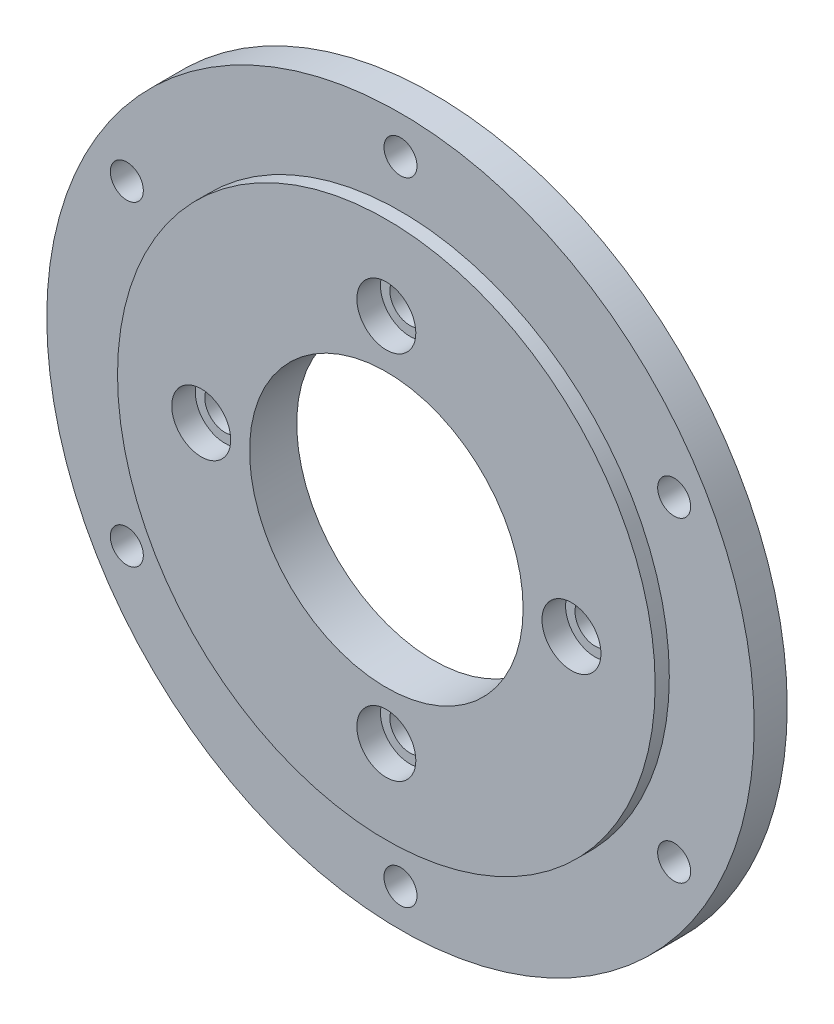
ISO-10303-21;
HEADER;
FILE_DESCRIPTION(('STEP AP214'),'2;1');
FILE_NAME('part.step','',(''),(''),'','','');
FILE_SCHEMA(('AUTOMOTIVE_DESIGN { 1 0 10303 214 1 1 1 1 }'));
ENDSEC;
DATA;
#1=APPLICATION_CONTEXT('core data for automotive mechanical design processes');
#2=APPLICATION_PROTOCOL_DEFINITION('international standard','automotive_design',2000,#1);
#3=PRODUCT_CONTEXT('',#1,'mechanical');
#4=PRODUCT('Part','Part','',(#3));
#5=PRODUCT_RELATED_PRODUCT_CATEGORY('part','',(#4));
#6=PRODUCT_DEFINITION_FORMATION('','',#4);
#7=PRODUCT_DEFINITION_CONTEXT('part definition',#1,'design');
#8=PRODUCT_DEFINITION('design','',#6,#7);
#9=PRODUCT_DEFINITION_SHAPE('','',#8);
#10=(LENGTH_UNIT() NAMED_UNIT(*) SI_UNIT(.MILLI.,.METRE.));
#11=(NAMED_UNIT(*) PLANE_ANGLE_UNIT() SI_UNIT($,.RADIAN.));
#12=(NAMED_UNIT(*) SI_UNIT($,.STERADIAN.) SOLID_ANGLE_UNIT());
#13=UNCERTAINTY_MEASURE_WITH_UNIT(LENGTH_MEASURE(1.E-05),#10,'distance_accuracy_value','');
#14=(GEOMETRIC_REPRESENTATION_CONTEXT(3) GLOBAL_UNCERTAINTY_ASSIGNED_CONTEXT((#13)) GLOBAL_UNIT_ASSIGNED_CONTEXT((#10,
#11,#12)) REPRESENTATION_CONTEXT('',''));
#15=CARTESIAN_POINT('',(0.,0.,0.));
#16=DIRECTION('',(0.,0.,1.));
#17=DIRECTION('',(1.,0.,0.));
#18=AXIS2_PLACEMENT_3D('',#15,#16,#17);
#19=CARTESIAN_POINT('',(0.,0.,10.));
#20=DIRECTION('',(0.,0.,1.));
#21=DIRECTION('',(1.,0.,0.));
#22=AXIS2_PLACEMENT_3D('',#19,#20,#21);
#23=PLANE('',#22);
#24=CARTESIAN_POINT('',(39.25,4.11121927648779E-13,10.));
#25=DIRECTION('',(0.,0.,1.));
#26=DIRECTION('',(1.,0.,0.));
#27=AXIS2_PLACEMENT_3D('',#24,#25,#26);
#28=CIRCLE('',#27,6.25000000000001);
#29=CARTESIAN_POINT('',(45.5,4.11121927648779E-13,10.));
#30=VERTEX_POINT('',#29);
#31=EDGE_CURVE('E129',#30,#30,#28,.T.);
#32=ORIENTED_EDGE('',*,*,#31,.F.);
#33=EDGE_LOOP('',(#32));
#34=FACE_BOUND('',#33,.T.);
#35=CARTESIAN_POINT('',(0.,-39.25,10.));
#36=DIRECTION('',(0.,0.,1.));
#37=DIRECTION('',(1.,0.,0.));
#38=AXIS2_PLACEMENT_3D('',#35,#36,#37);
#39=CIRCLE('',#38,6.25000000000001);
#40=CARTESIAN_POINT('',(6.25000000000001,-39.25,10.));
#41=VERTEX_POINT('',#40);
#42=EDGE_CURVE('E113',#41,#41,#39,.T.);
#43=ORIENTED_EDGE('',*,*,#42,.F.);
#44=EDGE_LOOP('',(#43));
#45=FACE_BOUND('',#44,.T.);
#46=CARTESIAN_POINT('',(-39.25,-1.37040642549593E-13,10.));
#47=DIRECTION('',(0.,0.,1.));
#48=DIRECTION('',(1.,0.,0.));
#49=AXIS2_PLACEMENT_3D('',#46,#47,#48);
#50=CIRCLE('',#49,6.25000000000001);
#51=CARTESIAN_POINT('',(-33.,-1.37040642549593E-13,10.));
#52=VERTEX_POINT('',#51);
#53=EDGE_CURVE('E97',#52,#52,#50,.T.);
#54=ORIENTED_EDGE('',*,*,#53,.F.);
#55=EDGE_LOOP('',(#54));
#56=FACE_BOUND('',#55,.T.);
#57=CARTESIAN_POINT('',(0.,39.25,10.));
#58=DIRECTION('',(0.,0.,1.));
#59=DIRECTION('',(1.,0.,0.));
#60=AXIS2_PLACEMENT_3D('',#57,#58,#59);
#61=CIRCLE('',#60,6.25000000000001);
#62=CARTESIAN_POINT('',(6.25000000000001,39.25,10.));
#63=VERTEX_POINT('',#62);
#64=EDGE_CURVE('E81',#63,#63,#61,.T.);
#65=ORIENTED_EDGE('',*,*,#64,.F.);
#66=EDGE_LOOP('',(#65));
#67=FACE_BOUND('',#66,.T.);
#68=CARTESIAN_POINT('',(0.,0.,10.));
#69=DIRECTION('',(0.,0.,1.));
#70=DIRECTION('',(1.,0.,0.));
#71=AXIS2_PLACEMENT_3D('',#68,#69,#70);
#72=CIRCLE('',#71,29.);
#73=CARTESIAN_POINT('',(29.,0.,10.));
#74=VERTEX_POINT('',#73);
#75=EDGE_CURVE('E50',#74,#74,#72,.T.);
#76=ORIENTED_EDGE('',*,*,#75,.F.);
#77=EDGE_LOOP('',(#76));
#78=FACE_BOUND('',#77,.T.);
#79=CARTESIAN_POINT('',(0.,0.,10.));
#80=DIRECTION('',(0.,0.,1.));
#81=DIRECTION('',(1.,0.,0.));
#82=AXIS2_PLACEMENT_3D('',#79,#80,#81);
#83=CIRCLE('',#82,57.);
#84=CARTESIAN_POINT('',(57.,0.,10.));
#85=VERTEX_POINT('',#84);
#86=EDGE_CURVE('E61',#85,#85,#83,.T.);
#87=ORIENTED_EDGE('',*,*,#86,.T.);
#88=EDGE_LOOP('',(#87));
#89=FACE_BOUND('',#88,.T.);
#90=ADVANCED_FACE('F41',(#34,#45,#56,#67,#78,#89),#23,.T.);
#91=CARTESIAN_POINT('',(0.,0.,10.));
#92=DIRECTION('',(0.,0.,-1.));
#93=DIRECTION('',(-1.,0.,0.));
#94=AXIS2_PLACEMENT_3D('',#91,#92,#93);
#95=CYLINDRICAL_SURFACE('',#94,75.);
#96=CARTESIAN_POINT('',(0.,0.,0.));
#97=DIRECTION('',(0.,0.,1.));
#98=DIRECTION('',(1.,0.,0.));
#99=AXIS2_PLACEMENT_3D('',#96,#97,#98);
#100=CIRCLE('',#99,75.);
#101=CARTESIAN_POINT('',(75.,0.,0.));
#102=VERTEX_POINT('',#101);
#103=EDGE_CURVE('E10',#102,#102,#100,.T.);
#104=ORIENTED_EDGE('',*,*,#103,.T.);
#105=EDGE_LOOP('',(#104));
#106=FACE_BOUND('',#105,.T.);
#107=CARTESIAN_POINT('',(0.,0.,7.));
#108=DIRECTION('',(0.,0.,1.));
#109=DIRECTION('',(1.,0.,0.));
#110=AXIS2_PLACEMENT_3D('',#107,#108,#109);
#111=CIRCLE('',#110,75.);
#112=CARTESIAN_POINT('',(75.,0.,7.));
#113=VERTEX_POINT('',#112);
#114=EDGE_CURVE('E45',#113,#113,#111,.T.);
#115=ORIENTED_EDGE('',*,*,#114,.F.);
#116=EDGE_LOOP('',(#115));
#117=FACE_BOUND('',#116,.T.);
#118=ADVANCED_FACE('F43',(#106,#117),#95,.T.);
#119=CARTESIAN_POINT('',(0.,0.,0.));
#120=DIRECTION('',(0.,0.,1.));
#121=DIRECTION('',(1.,0.,0.));
#122=AXIS2_PLACEMENT_3D('',#119,#120,#121);
#123=PLANE('',#122);
#124=CARTESIAN_POINT('',(58.023702053557,33.5000000000007,0.));
#125=DIRECTION('',(0.,0.,1.));
#126=DIRECTION('',(1.,0.,0.));
#127=AXIS2_PLACEMENT_3D('',#124,#125,#126);
#128=CIRCLE('',#127,3.50000000000001);
#129=CARTESIAN_POINT('',(61.523702053557,33.5000000000007,0.));
#130=VERTEX_POINT('',#129);
#131=EDGE_CURVE('E173',#130,#130,#128,.T.);
#132=ORIENTED_EDGE('',*,*,#131,.T.);
#133=EDGE_LOOP('',(#132));
#134=FACE_BOUND('',#133,.T.);
#135=CARTESIAN_POINT('',(58.0237020535577,-33.4999999999994,0.));
#136=DIRECTION('',(0.,0.,1.));
#137=DIRECTION('',(1.,0.,0.));
#138=AXIS2_PLACEMENT_3D('',#135,#136,#137);
#139=CIRCLE('',#138,3.50000000000001);
#140=CARTESIAN_POINT('',(61.5237020535577,-33.4999999999994,0.));
#141=VERTEX_POINT('',#140);
#142=EDGE_CURVE('E165',#141,#141,#139,.T.);
#143=ORIENTED_EDGE('',*,*,#142,.T.);
#144=EDGE_LOOP('',(#143));
#145=FACE_BOUND('',#144,.T.);
#146=CARTESIAN_POINT('',(0.,-67.,0.));
#147=DIRECTION('',(0.,0.,1.));
#148=DIRECTION('',(1.,0.,0.));
#149=AXIS2_PLACEMENT_3D('',#146,#147,#148);
#150=CIRCLE('',#149,3.50000000000001);
#151=CARTESIAN_POINT('',(3.50000000000001,-67.,0.));
#152=VERTEX_POINT('',#151);
#153=EDGE_CURVE('E157',#152,#152,#150,.T.);
#154=ORIENTED_EDGE('',*,*,#153,.T.);
#155=EDGE_LOOP('',(#154));
#156=FACE_BOUND('',#155,.T.);
#157=CARTESIAN_POINT('',(-58.0237020535572,-33.5000000000003,0.));
#158=DIRECTION('',(0.,0.,1.));
#159=DIRECTION('',(1.,0.,0.));
#160=AXIS2_PLACEMENT_3D('',#157,#158,#159);
#161=CIRCLE('',#160,3.50000000000002);
#162=CARTESIAN_POINT('',(-54.5237020535572,-33.5000000000003,0.));
#163=VERTEX_POINT('',#162);
#164=EDGE_CURVE('E149',#163,#163,#161,.T.);
#165=ORIENTED_EDGE('',*,*,#164,.T.);
#166=EDGE_LOOP('',(#165));
#167=FACE_BOUND('',#166,.T.);
#168=CARTESIAN_POINT('',(-58.0237020535574,33.4999999999999,0.));
#169=DIRECTION('',(0.,0.,1.));
#170=DIRECTION('',(1.,0.,0.));
#171=AXIS2_PLACEMENT_3D('',#168,#169,#170);
#172=CIRCLE('',#171,3.50000000000002);
#173=CARTESIAN_POINT('',(-54.5237020535574,33.4999999999999,0.));
#174=VERTEX_POINT('',#173);
#175=EDGE_CURVE('E141',#174,#174,#172,.T.);
#176=ORIENTED_EDGE('',*,*,#175,.T.);
#177=EDGE_LOOP('',(#176));
#178=FACE_BOUND('',#177,.T.);
#179=CARTESIAN_POINT('',(0.,67.,0.));
#180=DIRECTION('',(0.,0.,1.));
#181=DIRECTION('',(1.,0.,0.));
#182=AXIS2_PLACEMENT_3D('',#179,#180,#181);
#183=CIRCLE('',#182,3.50000000000001);
#184=CARTESIAN_POINT('',(3.50000000000001,67.,0.));
#185=VERTEX_POINT('',#184);
#186=EDGE_CURVE('E133',#185,#185,#183,.T.);
#187=ORIENTED_EDGE('',*,*,#186,.T.);
#188=EDGE_LOOP('',(#187));
#189=FACE_BOUND('',#188,.T.);
#190=CARTESIAN_POINT('',(39.25,4.11121927648779E-13,0.));
#191=DIRECTION('',(0.,0.,1.));
#192=DIRECTION('',(1.,0.,0.));
#193=AXIS2_PLACEMENT_3D('',#190,#191,#192);
#194=CIRCLE('',#193,4.25000000000001);
#195=CARTESIAN_POINT('',(43.5,4.11121927648779E-13,0.));
#196=VERTEX_POINT('',#195);
#197=EDGE_CURVE('E117',#196,#196,#194,.T.);
#198=ORIENTED_EDGE('',*,*,#197,.T.);
#199=EDGE_LOOP('',(#198));
#200=FACE_BOUND('',#199,.T.);
#201=CARTESIAN_POINT('',(0.,-39.25,0.));
#202=DIRECTION('',(0.,0.,1.));
#203=DIRECTION('',(1.,0.,0.));
#204=AXIS2_PLACEMENT_3D('',#201,#202,#203);
#205=CIRCLE('',#204,4.25000000000001);
#206=CARTESIAN_POINT('',(4.25000000000001,-39.25,0.));
#207=VERTEX_POINT('',#206);
#208=EDGE_CURVE('E101',#207,#207,#205,.T.);
#209=ORIENTED_EDGE('',*,*,#208,.T.);
#210=EDGE_LOOP('',(#209));
#211=FACE_BOUND('',#210,.T.);
#212=CARTESIAN_POINT('',(-39.25,-1.37040642549593E-13,0.));
#213=DIRECTION('',(0.,0.,1.));
#214=DIRECTION('',(1.,0.,0.));
#215=AXIS2_PLACEMENT_3D('',#212,#213,#214);
#216=CIRCLE('',#215,4.25000000000001);
#217=CARTESIAN_POINT('',(-35.,-1.37040642549593E-13,0.));
#218=VERTEX_POINT('',#217);
#219=EDGE_CURVE('E85',#218,#218,#216,.T.);
#220=ORIENTED_EDGE('',*,*,#219,.T.);
#221=EDGE_LOOP('',(#220));
#222=FACE_BOUND('',#221,.T.);
#223=CARTESIAN_POINT('',(0.,39.25,0.));
#224=DIRECTION('',(0.,0.,1.));
#225=DIRECTION('',(1.,0.,0.));
#226=AXIS2_PLACEMENT_3D('',#223,#224,#225);
#227=CIRCLE('',#226,4.25000000000001);
#228=CARTESIAN_POINT('',(4.25000000000001,39.25,0.));
#229=VERTEX_POINT('',#228);
#230=EDGE_CURVE('E66',#229,#229,#227,.T.);
#231=ORIENTED_EDGE('',*,*,#230,.T.);
#232=EDGE_LOOP('',(#231));
#233=FACE_BOUND('',#232,.T.);
#234=ORIENTED_EDGE('',*,*,#103,.F.);
#235=EDGE_LOOP('',(#234));
#236=FACE_BOUND('',#235,.T.);
#237=CARTESIAN_POINT('',(0.,0.,0.));
#238=DIRECTION('',(0.,0.,1.));
#239=DIRECTION('',(1.,0.,0.));
#240=AXIS2_PLACEMENT_3D('',#237,#238,#239);
#241=CIRCLE('',#240,29.);
#242=CARTESIAN_POINT('',(29.,0.,0.));
#243=VERTEX_POINT('',#242);
#244=EDGE_CURVE('E55',#243,#243,#241,.T.);
#245=ORIENTED_EDGE('',*,*,#244,.T.);
#246=EDGE_LOOP('',(#245));
#247=FACE_BOUND('',#246,.T.);
#248=ADVANCED_FACE('F207',(#134,#145,#156,#167,#178,#189,#200,#211,#222,#233,#236,#247),#123,.F.);
#249=CARTESIAN_POINT('',(0.,0.,10.));
#250=DIRECTION('',(0.,0.,-1.));
#251=DIRECTION('',(-1.,0.,0.));
#252=AXIS2_PLACEMENT_3D('',#249,#250,#251);
#253=CYLINDRICAL_SURFACE('',#252,29.);
#254=ORIENTED_EDGE('',*,*,#75,.T.);
#255=EDGE_LOOP('',(#254));
#256=FACE_BOUND('',#255,.T.);
#257=ORIENTED_EDGE('',*,*,#244,.F.);
#258=EDGE_LOOP('',(#257));
#259=FACE_BOUND('',#258,.T.);
#260=ADVANCED_FACE('F188',(#256,#259),#253,.F.);
#261=CARTESIAN_POINT('',(0.,0.,7.));
#262=DIRECTION('',(0.,0.,1.));
#263=DIRECTION('',(1.,0.,0.));
#264=AXIS2_PLACEMENT_3D('',#261,#262,#263);
#265=PLANE('',#264);
#266=CARTESIAN_POINT('',(58.023702053557,33.5000000000007,7.));
#267=DIRECTION('',(0.,0.,1.));
#268=DIRECTION('',(1.,0.,0.));
#269=AXIS2_PLACEMENT_3D('',#266,#267,#268);
#270=CIRCLE('',#269,3.50000000000002);
#271=CARTESIAN_POINT('',(61.523702053557,33.5000000000007,7.));
#272=VERTEX_POINT('',#271);
#273=EDGE_CURVE('E177',#272,#272,#270,.T.);
#274=ORIENTED_EDGE('',*,*,#273,.F.);
#275=EDGE_LOOP('',(#274));
#276=FACE_BOUND('',#275,.T.);
#277=CARTESIAN_POINT('',(58.0237020535577,-33.4999999999994,7.));
#278=DIRECTION('',(0.,0.,1.));
#279=DIRECTION('',(1.,0.,0.));
#280=AXIS2_PLACEMENT_3D('',#277,#278,#279);
#281=CIRCLE('',#280,3.50000000000002);
#282=CARTESIAN_POINT('',(61.5237020535577,-33.4999999999994,7.));
#283=VERTEX_POINT('',#282);
#284=EDGE_CURVE('E169',#283,#283,#281,.T.);
#285=ORIENTED_EDGE('',*,*,#284,.F.);
#286=EDGE_LOOP('',(#285));
#287=FACE_BOUND('',#286,.T.);
#288=CARTESIAN_POINT('',(0.,-67.,7.));
#289=DIRECTION('',(0.,0.,1.));
#290=DIRECTION('',(1.,0.,0.));
#291=AXIS2_PLACEMENT_3D('',#288,#289,#290);
#292=CIRCLE('',#291,3.50000000000001);
#293=CARTESIAN_POINT('',(3.50000000000001,-67.,7.));
#294=VERTEX_POINT('',#293);
#295=EDGE_CURVE('E161',#294,#294,#292,.T.);
#296=ORIENTED_EDGE('',*,*,#295,.F.);
#297=EDGE_LOOP('',(#296));
#298=FACE_BOUND('',#297,.T.);
#299=CARTESIAN_POINT('',(-58.0237020535572,-33.5000000000003,7.));
#300=DIRECTION('',(0.,0.,1.));
#301=DIRECTION('',(1.,0.,0.));
#302=AXIS2_PLACEMENT_3D('',#299,#300,#301);
#303=CIRCLE('',#302,3.50000000000002);
#304=CARTESIAN_POINT('',(-54.5237020535572,-33.5000000000003,7.));
#305=VERTEX_POINT('',#304);
#306=EDGE_CURVE('E153',#305,#305,#303,.T.);
#307=ORIENTED_EDGE('',*,*,#306,.F.);
#308=EDGE_LOOP('',(#307));
#309=FACE_BOUND('',#308,.T.);
#310=CARTESIAN_POINT('',(-58.0237020535574,33.4999999999999,7.));
#311=DIRECTION('',(0.,0.,1.));
#312=DIRECTION('',(1.,0.,0.));
#313=AXIS2_PLACEMENT_3D('',#310,#311,#312);
#314=CIRCLE('',#313,3.50000000000002);
#315=CARTESIAN_POINT('',(-54.5237020535574,33.4999999999999,7.));
#316=VERTEX_POINT('',#315);
#317=EDGE_CURVE('E145',#316,#316,#314,.T.);
#318=ORIENTED_EDGE('',*,*,#317,.F.);
#319=EDGE_LOOP('',(#318));
#320=FACE_BOUND('',#319,.T.);
#321=CARTESIAN_POINT('',(0.,67.,7.));
#322=DIRECTION('',(0.,0.,1.));
#323=DIRECTION('',(1.,0.,0.));
#324=AXIS2_PLACEMENT_3D('',#321,#322,#323);
#325=CIRCLE('',#324,3.50000000000001);
#326=CARTESIAN_POINT('',(3.50000000000001,67.,7.));
#327=VERTEX_POINT('',#326);
#328=EDGE_CURVE('E137',#327,#327,#325,.T.);
#329=ORIENTED_EDGE('',*,*,#328,.F.);
#330=EDGE_LOOP('',(#329));
#331=FACE_BOUND('',#330,.T.);
#332=CARTESIAN_POINT('',(0.,0.,7.));
#333=DIRECTION('',(0.,0.,1.));
#334=DIRECTION('',(1.,0.,0.));
#335=AXIS2_PLACEMENT_3D('',#332,#333,#334);
#336=CIRCLE('',#335,57.);
#337=CARTESIAN_POINT('',(57.,0.,7.));
#338=VERTEX_POINT('',#337);
#339=EDGE_CURVE('E65',#338,#338,#336,.T.);
#340=ORIENTED_EDGE('',*,*,#339,.F.);
#341=EDGE_LOOP('',(#340));
#342=FACE_BOUND('',#341,.T.);
#343=ORIENTED_EDGE('',*,*,#114,.T.);
#344=EDGE_LOOP('',(#343));
#345=FACE_BOUND('',#344,.T.);
#346=ADVANCED_FACE('F184',(#276,#287,#298,#309,#320,#331,#342,#345),#265,.T.);
#347=CARTESIAN_POINT('',(0.,0.,7.));
#348=DIRECTION('',(0.,0.,1.));
#349=DIRECTION('',(1.,0.,0.));
#350=AXIS2_PLACEMENT_3D('',#347,#348,#349);
#351=CYLINDRICAL_SURFACE('',#350,57.);
#352=ORIENTED_EDGE('',*,*,#339,.T.);
#353=EDGE_LOOP('',(#352));
#354=FACE_BOUND('',#353,.T.);
#355=ORIENTED_EDGE('',*,*,#86,.F.);
#356=EDGE_LOOP('',(#355));
#357=FACE_BOUND('',#356,.T.);
#358=ADVANCED_FACE('F187',(#354,#357),#351,.T.);
#359=CARTESIAN_POINT('',(0.,39.25,10.));
#360=DIRECTION('',(0.,0.,1.));
#361=DIRECTION('',(1.,0.,0.));
#362=AXIS2_PLACEMENT_3D('',#359,#360,#361);
#363=CYLINDRICAL_SURFACE('',#362,4.25000000000001);
#364=ORIENTED_EDGE('',*,*,#230,.F.);
#365=EDGE_LOOP('',(#364));
#366=FACE_BOUND('',#365,.T.);
#367=CARTESIAN_POINT('',(0.,39.25,5.));
#368=DIRECTION('',(0.,0.,1.));
#369=DIRECTION('',(1.,0.,0.));
#370=AXIS2_PLACEMENT_3D('',#367,#368,#369);
#371=CIRCLE('',#370,4.25000000000001);
#372=CARTESIAN_POINT('',(4.25000000000001,39.25,5.));
#373=VERTEX_POINT('',#372);
#374=EDGE_CURVE('E73',#373,#373,#371,.T.);
#375=ORIENTED_EDGE('',*,*,#374,.T.);
#376=EDGE_LOOP('',(#375));
#377=FACE_BOUND('',#376,.T.);
#378=ADVANCED_FACE('F225',(#366,#377),#363,.F.);
#379=CARTESIAN_POINT('',(4.25000000000001,39.25,5.));
#380=DIRECTION('',(0.,0.,-1.));
#381=DIRECTION('',(-1.,0.,0.));
#382=AXIS2_PLACEMENT_3D('',#379,#380,#381);
#383=PLANE('',#382);
#384=ORIENTED_EDGE('',*,*,#374,.F.);
#385=EDGE_LOOP('',(#384));
#386=FACE_BOUND('',#385,.T.);
#387=CARTESIAN_POINT('',(0.,39.25,5.));
#388=DIRECTION('',(0.,0.,1.));
#389=DIRECTION('',(1.,0.,0.));
#390=AXIS2_PLACEMENT_3D('',#387,#388,#389);
#391=CIRCLE('',#390,6.25000000000001);
#392=CARTESIAN_POINT('',(6.25000000000001,39.25,5.));
#393=VERTEX_POINT('',#392);
#394=EDGE_CURVE('E77',#393,#393,#391,.T.);
#395=ORIENTED_EDGE('',*,*,#394,.T.);
#396=EDGE_LOOP('',(#395));
#397=FACE_BOUND('',#396,.T.);
#398=ADVANCED_FACE('F229',(#386,#397),#383,.F.);
#399=CARTESIAN_POINT('',(0.,39.25,10.));
#400=DIRECTION('',(0.,0.,1.));
#401=DIRECTION('',(1.,0.,0.));
#402=AXIS2_PLACEMENT_3D('',#399,#400,#401);
#403=CYLINDRICAL_SURFACE('',#402,6.25000000000001);
#404=ORIENTED_EDGE('',*,*,#394,.F.);
#405=EDGE_LOOP('',(#404));
#406=FACE_BOUND('',#405,.T.);
#407=ORIENTED_EDGE('',*,*,#64,.T.);
#408=EDGE_LOOP('',(#407));
#409=FACE_BOUND('',#408,.T.);
#410=ADVANCED_FACE('F233',(#406,#409),#403,.F.);
#411=CARTESIAN_POINT('',(-39.25,-1.37040642549593E-13,10.));
#412=DIRECTION('',(0.,0.,1.));
#413=DIRECTION('',(1.,0.,0.));
#414=AXIS2_PLACEMENT_3D('',#411,#412,#413);
#415=CYLINDRICAL_SURFACE('',#414,4.25000000000001);
#416=ORIENTED_EDGE('',*,*,#219,.F.);
#417=EDGE_LOOP('',(#416));
#418=FACE_BOUND('',#417,.T.);
#419=CARTESIAN_POINT('',(-39.25,-1.37040642549593E-13,5.));
#420=DIRECTION('',(0.,0.,1.));
#421=DIRECTION('',(1.,0.,0.));
#422=AXIS2_PLACEMENT_3D('',#419,#420,#421);
#423=CIRCLE('',#422,4.25000000000001);
#424=CARTESIAN_POINT('',(-35.,-1.37040642549593E-13,5.));
#425=VERTEX_POINT('',#424);
#426=EDGE_CURVE('E89',#425,#425,#423,.T.);
#427=ORIENTED_EDGE('',*,*,#426,.T.);
#428=EDGE_LOOP('',(#427));
#429=FACE_BOUND('',#428,.T.);
#430=ADVANCED_FACE('F237',(#418,#429),#415,.F.);
#431=CARTESIAN_POINT('',(-35.,-1.37040642549593E-13,5.));
#432=DIRECTION('',(0.,0.,-1.));
#433=DIRECTION('',(-1.,0.,0.));
#434=AXIS2_PLACEMENT_3D('',#431,#432,#433);
#435=PLANE('',#434);
#436=ORIENTED_EDGE('',*,*,#426,.F.);
#437=EDGE_LOOP('',(#436));
#438=FACE_BOUND('',#437,.T.);
#439=CARTESIAN_POINT('',(-39.25,-1.37040642549593E-13,5.));
#440=DIRECTION('',(0.,0.,1.));
#441=DIRECTION('',(1.,0.,0.));
#442=AXIS2_PLACEMENT_3D('',#439,#440,#441);
#443=CIRCLE('',#442,6.25000000000001);
#444=CARTESIAN_POINT('',(-33.,-1.37040642549593E-13,5.));
#445=VERTEX_POINT('',#444);
#446=EDGE_CURVE('E93',#445,#445,#443,.T.);
#447=ORIENTED_EDGE('',*,*,#446,.T.);
#448=EDGE_LOOP('',(#447));
#449=FACE_BOUND('',#448,.T.);
#450=ADVANCED_FACE('F241',(#438,#449),#435,.F.);
#451=CARTESIAN_POINT('',(-39.25,-1.37040642549593E-13,10.));
#452=DIRECTION('',(0.,0.,1.));
#453=DIRECTION('',(1.,0.,0.));
#454=AXIS2_PLACEMENT_3D('',#451,#452,#453);
#455=CYLINDRICAL_SURFACE('',#454,6.25000000000001);
#456=ORIENTED_EDGE('',*,*,#446,.F.);
#457=EDGE_LOOP('',(#456));
#458=FACE_BOUND('',#457,.T.);
#459=ORIENTED_EDGE('',*,*,#53,.T.);
#460=EDGE_LOOP('',(#459));
#461=FACE_BOUND('',#460,.T.);
#462=ADVANCED_FACE('F245',(#458,#461),#455,.F.);
#463=CARTESIAN_POINT('',(0.,-39.25,10.));
#464=DIRECTION('',(0.,0.,1.));
#465=DIRECTION('',(1.,0.,0.));
#466=AXIS2_PLACEMENT_3D('',#463,#464,#465);
#467=CYLINDRICAL_SURFACE('',#466,4.25000000000001);
#468=ORIENTED_EDGE('',*,*,#208,.F.);
#469=EDGE_LOOP('',(#468));
#470=FACE_BOUND('',#469,.T.);
#471=CARTESIAN_POINT('',(0.,-39.25,5.));
#472=DIRECTION('',(0.,0.,1.));
#473=DIRECTION('',(1.,0.,0.));
#474=AXIS2_PLACEMENT_3D('',#471,#472,#473);
#475=CIRCLE('',#474,4.25000000000001);
#476=CARTESIAN_POINT('',(4.25000000000001,-39.25,5.));
#477=VERTEX_POINT('',#476);
#478=EDGE_CURVE('E105',#477,#477,#475,.T.);
#479=ORIENTED_EDGE('',*,*,#478,.T.);
#480=EDGE_LOOP('',(#479));
#481=FACE_BOUND('',#480,.T.);
#482=ADVANCED_FACE('F249',(#470,#481),#467,.F.);
#483=CARTESIAN_POINT('',(4.25000000000001,-39.25,5.));
#484=DIRECTION('',(0.,0.,-1.));
#485=DIRECTION('',(-1.,0.,0.));
#486=AXIS2_PLACEMENT_3D('',#483,#484,#485);
#487=PLANE('',#486);
#488=ORIENTED_EDGE('',*,*,#478,.F.);
#489=EDGE_LOOP('',(#488));
#490=FACE_BOUND('',#489,.T.);
#491=CARTESIAN_POINT('',(0.,-39.25,5.));
#492=DIRECTION('',(0.,0.,1.));
#493=DIRECTION('',(1.,0.,0.));
#494=AXIS2_PLACEMENT_3D('',#491,#492,#493);
#495=CIRCLE('',#494,6.25000000000001);
#496=CARTESIAN_POINT('',(6.25000000000001,-39.25,5.));
#497=VERTEX_POINT('',#496);
#498=EDGE_CURVE('E109',#497,#497,#495,.T.);
#499=ORIENTED_EDGE('',*,*,#498,.T.);
#500=EDGE_LOOP('',(#499));
#501=FACE_BOUND('',#500,.T.);
#502=ADVANCED_FACE('F253',(#490,#501),#487,.F.);
#503=CARTESIAN_POINT('',(0.,-39.25,10.));
#504=DIRECTION('',(0.,0.,1.));
#505=DIRECTION('',(1.,0.,0.));
#506=AXIS2_PLACEMENT_3D('',#503,#504,#505);
#507=CYLINDRICAL_SURFACE('',#506,6.25000000000001);
#508=ORIENTED_EDGE('',*,*,#498,.F.);
#509=EDGE_LOOP('',(#508));
#510=FACE_BOUND('',#509,.T.);
#511=ORIENTED_EDGE('',*,*,#42,.T.);
#512=EDGE_LOOP('',(#511));
#513=FACE_BOUND('',#512,.T.);
#514=ADVANCED_FACE('F257',(#510,#513),#507,.F.);
#515=CARTESIAN_POINT('',(39.25,4.11121927648779E-13,10.));
#516=DIRECTION('',(0.,0.,1.));
#517=DIRECTION('',(1.,0.,0.));
#518=AXIS2_PLACEMENT_3D('',#515,#516,#517);
#519=CYLINDRICAL_SURFACE('',#518,4.25000000000001);
#520=ORIENTED_EDGE('',*,*,#197,.F.);
#521=EDGE_LOOP('',(#520));
#522=FACE_BOUND('',#521,.T.);
#523=CARTESIAN_POINT('',(39.25,4.11121927648779E-13,5.));
#524=DIRECTION('',(0.,0.,1.));
#525=DIRECTION('',(1.,0.,0.));
#526=AXIS2_PLACEMENT_3D('',#523,#524,#525);
#527=CIRCLE('',#526,4.25000000000001);
#528=CARTESIAN_POINT('',(43.5,4.11121927648779E-13,5.));
#529=VERTEX_POINT('',#528);
#530=EDGE_CURVE('E121',#529,#529,#527,.T.);
#531=ORIENTED_EDGE('',*,*,#530,.T.);
#532=EDGE_LOOP('',(#531));
#533=FACE_BOUND('',#532,.T.);
#534=ADVANCED_FACE('F261',(#522,#533),#519,.F.);
#535=CARTESIAN_POINT('',(43.5,4.11121927648779E-13,5.));
#536=DIRECTION('',(0.,0.,-1.));
#537=DIRECTION('',(-1.,0.,0.));
#538=AXIS2_PLACEMENT_3D('',#535,#536,#537);
#539=PLANE('',#538);
#540=ORIENTED_EDGE('',*,*,#530,.F.);
#541=EDGE_LOOP('',(#540));
#542=FACE_BOUND('',#541,.T.);
#543=CARTESIAN_POINT('',(39.25,4.11121927648779E-13,5.));
#544=DIRECTION('',(0.,0.,1.));
#545=DIRECTION('',(1.,0.,0.));
#546=AXIS2_PLACEMENT_3D('',#543,#544,#545);
#547=CIRCLE('',#546,6.25000000000001);
#548=CARTESIAN_POINT('',(45.5,4.11121927648779E-13,5.));
#549=VERTEX_POINT('',#548);
#550=EDGE_CURVE('E125',#549,#549,#547,.T.);
#551=ORIENTED_EDGE('',*,*,#550,.T.);
#552=EDGE_LOOP('',(#551));
#553=FACE_BOUND('',#552,.T.);
#554=ADVANCED_FACE('F265',(#542,#553),#539,.F.);
#555=CARTESIAN_POINT('',(39.25,4.11121927648779E-13,10.));
#556=DIRECTION('',(0.,0.,1.));
#557=DIRECTION('',(1.,0.,0.));
#558=AXIS2_PLACEMENT_3D('',#555,#556,#557);
#559=CYLINDRICAL_SURFACE('',#558,6.25000000000001);
#560=ORIENTED_EDGE('',*,*,#550,.F.);
#561=EDGE_LOOP('',(#560));
#562=FACE_BOUND('',#561,.T.);
#563=ORIENTED_EDGE('',*,*,#31,.T.);
#564=EDGE_LOOP('',(#563));
#565=FACE_BOUND('',#564,.T.);
#566=ADVANCED_FACE('F269',(#562,#565),#559,.F.);
#567=CARTESIAN_POINT('',(0.,67.,7.));
#568=DIRECTION('',(0.,0.,1.));
#569=DIRECTION('',(1.,0.,0.));
#570=AXIS2_PLACEMENT_3D('',#567,#568,#569);
#571=CYLINDRICAL_SURFACE('',#570,3.50000000000001);
#572=ORIENTED_EDGE('',*,*,#186,.F.);
#573=EDGE_LOOP('',(#572));
#574=FACE_BOUND('',#573,.T.);
#575=ORIENTED_EDGE('',*,*,#328,.T.);
#576=EDGE_LOOP('',(#575));
#577=FACE_BOUND('',#576,.T.);
#578=ADVANCED_FACE('F273',(#574,#577),#571,.F.);
#579=CARTESIAN_POINT('',(-58.0237020535574,33.4999999999999,7.));
#580=DIRECTION('',(0.,0.,1.));
#581=DIRECTION('',(1.,0.,0.));
#582=AXIS2_PLACEMENT_3D('',#579,#580,#581);
#583=CYLINDRICAL_SURFACE('',#582,3.50000000000002);
#584=ORIENTED_EDGE('',*,*,#175,.F.);
#585=EDGE_LOOP('',(#584));
#586=FACE_BOUND('',#585,.T.);
#587=ORIENTED_EDGE('',*,*,#317,.T.);
#588=EDGE_LOOP('',(#587));
#589=FACE_BOUND('',#588,.T.);
#590=ADVANCED_FACE('F277',(#586,#589),#583,.F.);
#591=CARTESIAN_POINT('',(-58.0237020535572,-33.5000000000003,7.));
#592=DIRECTION('',(0.,0.,1.));
#593=DIRECTION('',(1.,0.,0.));
#594=AXIS2_PLACEMENT_3D('',#591,#592,#593);
#595=CYLINDRICAL_SURFACE('',#594,3.50000000000002);
#596=ORIENTED_EDGE('',*,*,#164,.F.);
#597=EDGE_LOOP('',(#596));
#598=FACE_BOUND('',#597,.T.);
#599=ORIENTED_EDGE('',*,*,#306,.T.);
#600=EDGE_LOOP('',(#599));
#601=FACE_BOUND('',#600,.T.);
#602=ADVANCED_FACE('F281',(#598,#601),#595,.F.);
#603=CARTESIAN_POINT('',(0.,-67.,7.));
#604=DIRECTION('',(0.,0.,1.));
#605=DIRECTION('',(1.,0.,0.));
#606=AXIS2_PLACEMENT_3D('',#603,#604,#605);
#607=CYLINDRICAL_SURFACE('',#606,3.50000000000001);
#608=ORIENTED_EDGE('',*,*,#153,.F.);
#609=EDGE_LOOP('',(#608));
#610=FACE_BOUND('',#609,.T.);
#611=ORIENTED_EDGE('',*,*,#295,.T.);
#612=EDGE_LOOP('',(#611));
#613=FACE_BOUND('',#612,.T.);
#614=ADVANCED_FACE('F285',(#610,#613),#607,.F.);
#615=CARTESIAN_POINT('',(58.0237020535577,-33.4999999999994,7.));
#616=DIRECTION('',(0.,0.,1.));
#617=DIRECTION('',(1.,0.,0.));
#618=AXIS2_PLACEMENT_3D('',#615,#616,#617);
#619=CYLINDRICAL_SURFACE('',#618,3.50000000000001);
#620=ORIENTED_EDGE('',*,*,#142,.F.);
#621=EDGE_LOOP('',(#620));
#622=FACE_BOUND('',#621,.T.);
#623=ORIENTED_EDGE('',*,*,#284,.T.);
#624=EDGE_LOOP('',(#623));
#625=FACE_BOUND('',#624,.T.);
#626=ADVANCED_FACE('F289',(#622,#625),#619,.F.);
#627=CARTESIAN_POINT('',(58.023702053557,33.5000000000007,7.));
#628=DIRECTION('',(0.,0.,1.));
#629=DIRECTION('',(1.,0.,0.));
#630=AXIS2_PLACEMENT_3D('',#627,#628,#629);
#631=CYLINDRICAL_SURFACE('',#630,3.50000000000001);
#632=ORIENTED_EDGE('',*,*,#131,.F.);
#633=EDGE_LOOP('',(#632));
#634=FACE_BOUND('',#633,.T.);
#635=ORIENTED_EDGE('',*,*,#273,.T.);
#636=EDGE_LOOP('',(#635));
#637=FACE_BOUND('',#636,.T.);
#638=ADVANCED_FACE('F182',(#634,#637),#631,.F.);
#639=CLOSED_SHELL('',(#90,#118,#248,#260,#346,#358,#378,#398,#410,#430,#450,#462,#482,#502,#514,
#534,#554,#566,#578,#590,#602,#614,#626,#638));
#640=MANIFOLD_SOLID_BREP('B2',#639);
#641=ADVANCED_BREP_SHAPE_REPRESENTATION('',(#18,#640),#14);
#642=SHAPE_DEFINITION_REPRESENTATION(#9,#641);
ENDSEC;
END-ISO-10303-21;
